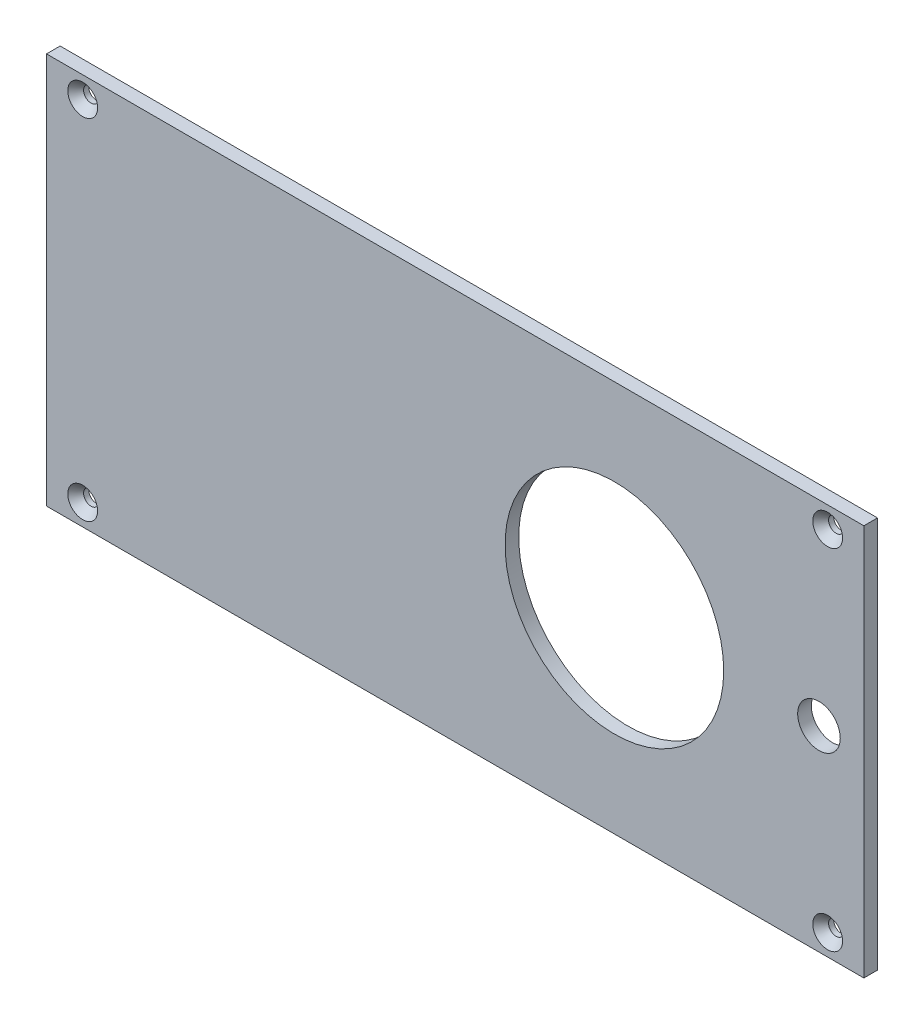
ISO-10303-21;
HEADER;
FILE_DESCRIPTION(('STEP AP214'),'2;1');
FILE_NAME('part.step','',(''),(''),'','','');
FILE_SCHEMA(('AUTOMOTIVE_DESIGN { 1 0 10303 214 1 1 1 1 }'));
ENDSEC;
DATA;
#1=APPLICATION_CONTEXT('core data for automotive mechanical design processes');
#2=APPLICATION_PROTOCOL_DEFINITION('international standard','automotive_design',2000,#1);
#3=PRODUCT_CONTEXT('',#1,'mechanical');
#4=PRODUCT('Part','Part','',(#3));
#5=PRODUCT_RELATED_PRODUCT_CATEGORY('part','',(#4));
#6=PRODUCT_DEFINITION_FORMATION('','',#4);
#7=PRODUCT_DEFINITION_CONTEXT('part definition',#1,'design');
#8=PRODUCT_DEFINITION('design','',#6,#7);
#9=PRODUCT_DEFINITION_SHAPE('','',#8);
#10=(LENGTH_UNIT() NAMED_UNIT(*) SI_UNIT(.MILLI.,.METRE.));
#11=(NAMED_UNIT(*) PLANE_ANGLE_UNIT() SI_UNIT($,.RADIAN.));
#12=(NAMED_UNIT(*) SI_UNIT($,.STERADIAN.) SOLID_ANGLE_UNIT());
#13=UNCERTAINTY_MEASURE_WITH_UNIT(LENGTH_MEASURE(1.E-05),#10,'distance_accuracy_value','');
#14=(GEOMETRIC_REPRESENTATION_CONTEXT(3) GLOBAL_UNCERTAINTY_ASSIGNED_CONTEXT((#13)) GLOBAL_UNIT_ASSIGNED_CONTEXT((#10,
#11,#12)) REPRESENTATION_CONTEXT('',''));
#15=CARTESIAN_POINT('',(0.,0.,0.));
#16=DIRECTION('',(0.,0.,1.));
#17=DIRECTION('',(1.,0.,0.));
#18=AXIS2_PLACEMENT_3D('',#15,#16,#17);
#19=CARTESIAN_POINT('',(0.,0.,1.6002));
#20=DIRECTION('',(1.,0.,0.));
#21=DIRECTION('',(0.,0.,-1.));
#22=AXIS2_PLACEMENT_3D('',#19,#20,#21);
#23=PLANE('',#22);
#24=DIRECTION('',(0.,-1.,0.));
#25=VECTOR('',#24,1.);
#26=CARTESIAN_POINT('',(0.,0.,0.));
#27=LINE('',#26,#25);
#28=CARTESIAN_POINT('',(0.,46.,0.));
#29=VERTEX_POINT('',#28);
#30=CARTESIAN_POINT('',(0.,0.,0.));
#31=VERTEX_POINT('',#30);
#32=EDGE_CURVE('E104',#29,#31,#27,.T.);
#33=ORIENTED_EDGE('',*,*,#32,.T.);
#34=DIRECTION('',(0.,0.,-1.));
#35=VECTOR('',#34,1.);
#36=CARTESIAN_POINT('',(0.,0.,1.6002));
#37=LINE('',#36,#35);
#38=CARTESIAN_POINT('',(0.,0.,1.6002));
#39=VERTEX_POINT('',#38);
#40=EDGE_CURVE('E11',#39,#31,#37,.T.);
#41=ORIENTED_EDGE('',*,*,#40,.F.);
#42=DIRECTION('',(0.,-1.,0.));
#43=VECTOR('',#42,1.);
#44=CARTESIAN_POINT('',(0.,0.,1.6002));
#45=LINE('',#44,#43);
#46=CARTESIAN_POINT('',(0.,46.,1.6002));
#47=VERTEX_POINT('',#46);
#48=EDGE_CURVE('E91',#47,#39,#45,.T.);
#49=ORIENTED_EDGE('',*,*,#48,.F.);
#50=DIRECTION('',(0.,0.,-1.));
#51=VECTOR('',#50,1.);
#52=CARTESIAN_POINT('',(0.,46.,1.6002));
#53=LINE('',#52,#51);
#54=EDGE_CURVE('E100',#47,#29,#53,.T.);
#55=ORIENTED_EDGE('',*,*,#54,.T.);
#56=EDGE_LOOP('',(#33,#41,#49,#55));
#57=FACE_BOUND('',#56,.T.);
#58=ADVANCED_FACE('F39',(#57),#23,.F.);
#59=CARTESIAN_POINT('',(0.,0.,1.6002));
#60=DIRECTION('',(0.,1.,0.));
#61=DIRECTION('',(0.,0.,1.));
#62=AXIS2_PLACEMENT_3D('',#59,#60,#61);
#63=PLANE('',#62);
#64=DIRECTION('',(1.,0.,0.));
#65=VECTOR('',#64,1.);
#66=CARTESIAN_POINT('',(0.,0.,0.));
#67=LINE('',#66,#65);
#68=CARTESIAN_POINT('',(96.,0.,0.));
#69=VERTEX_POINT('',#68);
#70=EDGE_CURVE('E95',#31,#69,#67,.T.);
#71=ORIENTED_EDGE('',*,*,#70,.T.);
#72=DIRECTION('',(0.,0.,-1.));
#73=VECTOR('',#72,1.);
#74=CARTESIAN_POINT('',(96.,0.,1.6002));
#75=LINE('',#74,#73);
#76=CARTESIAN_POINT('',(96.,0.,1.6002));
#77=VERTEX_POINT('',#76);
#78=EDGE_CURVE('E48',#77,#69,#75,.T.);
#79=ORIENTED_EDGE('',*,*,#78,.F.);
#80=DIRECTION('',(1.,0.,0.));
#81=VECTOR('',#80,1.);
#82=CARTESIAN_POINT('',(0.,0.,1.6002));
#83=LINE('',#82,#81);
#84=EDGE_CURVE('E86',#39,#77,#83,.T.);
#85=ORIENTED_EDGE('',*,*,#84,.F.);
#86=ORIENTED_EDGE('',*,*,#40,.T.);
#87=EDGE_LOOP('',(#71,#79,#85,#86));
#88=FACE_BOUND('',#87,.T.);
#89=ADVANCED_FACE('F94',(#88),#63,.F.);
#90=CARTESIAN_POINT('',(96.,0.,1.6002));
#91=DIRECTION('',(-1.,0.,0.));
#92=DIRECTION('',(0.,0.,1.));
#93=AXIS2_PLACEMENT_3D('',#90,#91,#92);
#94=PLANE('',#93);
#95=DIRECTION('',(0.,1.,0.));
#96=VECTOR('',#95,1.);
#97=CARTESIAN_POINT('',(96.,0.,0.));
#98=LINE('',#97,#96);
#99=CARTESIAN_POINT('',(96.,46.,0.));
#100=VERTEX_POINT('',#99);
#101=EDGE_CURVE('E73',#69,#100,#98,.T.);
#102=ORIENTED_EDGE('',*,*,#101,.T.);
#103=DIRECTION('',(0.,0.,-1.));
#104=VECTOR('',#103,1.);
#105=CARTESIAN_POINT('',(96.,46.,1.6002));
#106=LINE('',#105,#104);
#107=CARTESIAN_POINT('',(96.,46.,1.6002));
#108=VERTEX_POINT('',#107);
#109=EDGE_CURVE('E96',#108,#100,#106,.T.);
#110=ORIENTED_EDGE('',*,*,#109,.F.);
#111=DIRECTION('',(0.,1.,0.));
#112=VECTOR('',#111,1.);
#113=CARTESIAN_POINT('',(96.,0.,1.6002));
#114=LINE('',#113,#112);
#115=EDGE_CURVE('E89',#77,#108,#114,.T.);
#116=ORIENTED_EDGE('',*,*,#115,.F.);
#117=ORIENTED_EDGE('',*,*,#78,.T.);
#118=EDGE_LOOP('',(#102,#110,#116,#117));
#119=FACE_BOUND('',#118,.T.);
#120=ADVANCED_FACE('F98',(#119),#94,.F.);
#121=CARTESIAN_POINT('',(0.,46.,1.6002));
#122=DIRECTION('',(0.,-1.,0.));
#123=DIRECTION('',(0.,0.,-1.));
#124=AXIS2_PLACEMENT_3D('',#121,#122,#123);
#125=PLANE('',#124);
#126=DIRECTION('',(-1.,0.,0.));
#127=VECTOR('',#126,1.);
#128=CARTESIAN_POINT('',(0.,46.,0.));
#129=LINE('',#128,#127);
#130=EDGE_CURVE('E79',#100,#29,#129,.T.);
#131=ORIENTED_EDGE('',*,*,#130,.T.);
#132=ORIENTED_EDGE('',*,*,#54,.F.);
#133=DIRECTION('',(-1.,0.,0.));
#134=VECTOR('',#133,1.);
#135=CARTESIAN_POINT('',(0.,46.,1.6002));
#136=LINE('',#135,#134);
#137=EDGE_CURVE('E56',#108,#47,#136,.T.);
#138=ORIENTED_EDGE('',*,*,#137,.F.);
#139=ORIENTED_EDGE('',*,*,#109,.T.);
#140=EDGE_LOOP('',(#131,#132,#138,#139));
#141=FACE_BOUND('',#140,.T.);
#142=ADVANCED_FACE('F112',(#141),#125,.F.);
#143=CARTESIAN_POINT('',(0.,0.,1.6002));
#144=DIRECTION('',(0.,0.,-1.));
#145=DIRECTION('',(-1.,0.,0.));
#146=AXIS2_PLACEMENT_3D('',#143,#144,#145);
#147=PLANE('',#146);
#148=CARTESIAN_POINT('',(90.7270405436513,23.0000000000247,1.6002));
#149=DIRECTION('',(0.,0.,1.));
#150=DIRECTION('',(1.,0.,0.));
#151=AXIS2_PLACEMENT_3D('',#148,#149,#150);
#152=CIRCLE('',#151,2.50000000000001);
#153=CARTESIAN_POINT('',(93.2270405436513,23.0000000000247,1.6002));
#154=VERTEX_POINT('',#153);
#155=EDGE_CURVE('E159',#154,#154,#152,.T.);
#156=ORIENTED_EDGE('',*,*,#155,.F.);
#157=EDGE_LOOP('',(#156));
#158=FACE_BOUND('',#157,.T.);
#159=CARTESIAN_POINT('',(4.25,43.5,1.6002));
#160=DIRECTION('',(0.,0.,1.));
#161=DIRECTION('',(1.,0.,0.));
#162=AXIS2_PLACEMENT_3D('',#159,#160,#161);
#163=CIRCLE('',#162,1.7526);
#164=CARTESIAN_POINT('',(6.0026,43.5,1.6002));
#165=VERTEX_POINT('',#164);
#166=EDGE_CURVE('E156',#165,#165,#163,.T.);
#167=ORIENTED_EDGE('',*,*,#166,.F.);
#168=EDGE_LOOP('',(#167));
#169=FACE_BOUND('',#168,.T.);
#170=CARTESIAN_POINT('',(4.25000000000001,2.5,1.6002));
#171=DIRECTION('',(0.,0.,1.));
#172=DIRECTION('',(1.,0.,0.));
#173=AXIS2_PLACEMENT_3D('',#170,#171,#172);
#174=CIRCLE('',#173,1.7526);
#175=CARTESIAN_POINT('',(6.00260000000001,2.5,1.6002));
#176=VERTEX_POINT('',#175);
#177=EDGE_CURVE('E147',#176,#176,#174,.T.);
#178=ORIENTED_EDGE('',*,*,#177,.F.);
#179=EDGE_LOOP('',(#178));
#180=FACE_BOUND('',#179,.T.);
#181=CARTESIAN_POINT('',(91.75,2.50000000000002,1.6002));
#182=DIRECTION('',(0.,0.,1.));
#183=DIRECTION('',(1.,0.,0.));
#184=AXIS2_PLACEMENT_3D('',#181,#182,#183);
#185=CIRCLE('',#184,1.75259999999999);
#186=CARTESIAN_POINT('',(93.5026,2.50000000000002,1.6002));
#187=VERTEX_POINT('',#186);
#188=EDGE_CURVE('E138',#187,#187,#185,.T.);
#189=ORIENTED_EDGE('',*,*,#188,.F.);
#190=EDGE_LOOP('',(#189));
#191=FACE_BOUND('',#190,.T.);
#192=CARTESIAN_POINT('',(91.75,43.5,1.6002));
#193=DIRECTION('',(0.,0.,1.));
#194=DIRECTION('',(1.,0.,0.));
#195=AXIS2_PLACEMENT_3D('',#192,#193,#194);
#196=CIRCLE('',#195,1.75259999999999);
#197=CARTESIAN_POINT('',(93.5026,43.5,1.6002));
#198=VERTEX_POINT('',#197);
#199=EDGE_CURVE('E129',#198,#198,#196,.T.);
#200=ORIENTED_EDGE('',*,*,#199,.F.);
#201=EDGE_LOOP('',(#200));
#202=FACE_BOUND('',#201,.T.);
#203=CARTESIAN_POINT('',(66.7000000001694,23.0000000000245,1.6002));
#204=DIRECTION('',(0.,0.,1.));
#205=DIRECTION('',(1.,0.,0.));
#206=AXIS2_PLACEMENT_3D('',#203,#204,#205);
#207=CIRCLE('',#206,12.8396999999119);
#208=CARTESIAN_POINT('',(79.5397000000814,23.0000000000245,1.6002));
#209=VERTEX_POINT('',#208);
#210=EDGE_CURVE('E118',#209,#209,#207,.T.);
#211=ORIENTED_EDGE('',*,*,#210,.F.);
#212=EDGE_LOOP('',(#211));
#213=FACE_BOUND('',#212,.T.);
#214=ORIENTED_EDGE('',*,*,#48,.T.);
#215=ORIENTED_EDGE('',*,*,#84,.T.);
#216=ORIENTED_EDGE('',*,*,#115,.T.);
#217=ORIENTED_EDGE('',*,*,#137,.T.);
#218=EDGE_LOOP('',(#214,#215,#216,#217));
#219=FACE_BOUND('',#218,.T.);
#220=ADVANCED_FACE('F87',(#158,#169,#180,#191,#202,#213,#219),#147,.F.);
#221=CARTESIAN_POINT('',(0.,0.,0.));
#222=DIRECTION('',(0.,0.,-1.));
#223=DIRECTION('',(-1.,0.,0.));
#224=AXIS2_PLACEMENT_3D('',#221,#222,#223);
#225=PLANE('',#224);
#226=CARTESIAN_POINT('',(90.7270405436513,23.0000000000247,0.));
#227=DIRECTION('',(0.,0.,-1.));
#228=DIRECTION('',(-1.,0.,0.));
#229=AXIS2_PLACEMENT_3D('',#226,#227,#228);
#230=CIRCLE('',#229,2.50000000000001);
#231=CARTESIAN_POINT('',(88.2270405436512,23.0000000000247,0.));
#232=VERTEX_POINT('',#231);
#233=EDGE_CURVE('E42',#232,#232,#230,.T.);
#234=ORIENTED_EDGE('',*,*,#233,.F.);
#235=EDGE_LOOP('',(#234));
#236=FACE_BOUND('',#235,.T.);
#237=CARTESIAN_POINT('',(4.25,43.5,0.));
#238=DIRECTION('',(0.,0.,1.));
#239=DIRECTION('',(1.,0.,0.));
#240=AXIS2_PLACEMENT_3D('',#237,#238,#239);
#241=CIRCLE('',#240,0.888999999999999);
#242=CARTESIAN_POINT('',(5.139,43.5,0.));
#243=VERTEX_POINT('',#242);
#244=EDGE_CURVE('E150',#243,#243,#241,.T.);
#245=ORIENTED_EDGE('',*,*,#244,.T.);
#246=EDGE_LOOP('',(#245));
#247=FACE_BOUND('',#246,.T.);
#248=CARTESIAN_POINT('',(4.25000000000001,2.5,0.));
#249=DIRECTION('',(0.,0.,1.));
#250=DIRECTION('',(1.,0.,0.));
#251=AXIS2_PLACEMENT_3D('',#248,#249,#250);
#252=CIRCLE('',#251,0.888999999999999);
#253=CARTESIAN_POINT('',(5.139,2.5,0.));
#254=VERTEX_POINT('',#253);
#255=EDGE_CURVE('E141',#254,#254,#252,.T.);
#256=ORIENTED_EDGE('',*,*,#255,.T.);
#257=EDGE_LOOP('',(#256));
#258=FACE_BOUND('',#257,.T.);
#259=CARTESIAN_POINT('',(91.75,2.50000000000002,0.));
#260=DIRECTION('',(0.,0.,1.));
#261=DIRECTION('',(1.,0.,0.));
#262=AXIS2_PLACEMENT_3D('',#259,#260,#261);
#263=CIRCLE('',#262,0.889000000000001);
#264=CARTESIAN_POINT('',(92.639,2.50000000000002,0.));
#265=VERTEX_POINT('',#264);
#266=EDGE_CURVE('E132',#265,#265,#263,.T.);
#267=ORIENTED_EDGE('',*,*,#266,.T.);
#268=EDGE_LOOP('',(#267));
#269=FACE_BOUND('',#268,.T.);
#270=CARTESIAN_POINT('',(91.75,43.5,0.));
#271=DIRECTION('',(0.,0.,1.));
#272=DIRECTION('',(1.,0.,0.));
#273=AXIS2_PLACEMENT_3D('',#270,#271,#272);
#274=CIRCLE('',#273,0.889000000000001);
#275=CARTESIAN_POINT('',(92.639,43.5,0.));
#276=VERTEX_POINT('',#275);
#277=EDGE_CURVE('E121',#276,#276,#274,.T.);
#278=ORIENTED_EDGE('',*,*,#277,.T.);
#279=EDGE_LOOP('',(#278));
#280=FACE_BOUND('',#279,.T.);
#281=CARTESIAN_POINT('',(66.7000000001694,23.0000000000245,0.));
#282=DIRECTION('',(0.,0.,1.));
#283=DIRECTION('',(1.,0.,0.));
#284=AXIS2_PLACEMENT_3D('',#281,#282,#283);
#285=CIRCLE('',#284,12.8396999999119);
#286=CARTESIAN_POINT('',(79.5397000000814,23.0000000000245,0.));
#287=VERTEX_POINT('',#286);
#288=EDGE_CURVE('E107',#287,#287,#285,.T.);
#289=ORIENTED_EDGE('',*,*,#288,.T.);
#290=EDGE_LOOP('',(#289));
#291=FACE_BOUND('',#290,.T.);
#292=ORIENTED_EDGE('',*,*,#32,.F.);
#293=ORIENTED_EDGE('',*,*,#130,.F.);
#294=ORIENTED_EDGE('',*,*,#101,.F.);
#295=ORIENTED_EDGE('',*,*,#70,.F.);
#296=EDGE_LOOP('',(#292,#293,#294,#295));
#297=FACE_BOUND('',#296,.T.);
#298=ADVANCED_FACE('F115',(#236,#247,#258,#269,#280,#291,#297),#225,.T.);
#299=CARTESIAN_POINT('',(66.7000000001694,23.0000000000245,0.));
#300=DIRECTION('',(0.,0.,1.));
#301=DIRECTION('',(1.,0.,0.));
#302=AXIS2_PLACEMENT_3D('',#299,#300,#301);
#303=CYLINDRICAL_SURFACE('',#302,12.8396999999119);
#304=ORIENTED_EDGE('',*,*,#288,.F.);
#305=EDGE_LOOP('',(#304));
#306=FACE_BOUND('',#305,.T.);
#307=ORIENTED_EDGE('',*,*,#210,.T.);
#308=EDGE_LOOP('',(#307));
#309=FACE_BOUND('',#308,.T.);
#310=ADVANCED_FACE('F170',(#306,#309),#303,.F.);
#311=CARTESIAN_POINT('',(91.75,43.5,1.6002));
#312=DIRECTION('',(0.,0.,1.));
#313=DIRECTION('',(1.,0.,0.));
#314=AXIS2_PLACEMENT_3D('',#311,#312,#313);
#315=CYLINDRICAL_SURFACE('',#314,0.889000000000001);
#316=ORIENTED_EDGE('',*,*,#277,.F.);
#317=EDGE_LOOP('',(#316));
#318=FACE_BOUND('',#317,.T.);
#319=CARTESIAN_POINT('',(91.75,43.5,0.606741843523936));
#320=DIRECTION('',(0.,0.,1.));
#321=DIRECTION('',(1.,0.,0.));
#322=AXIS2_PLACEMENT_3D('',#319,#320,#321);
#323=CIRCLE('',#322,0.889000000000001);
#324=CARTESIAN_POINT('',(92.639,43.5,0.606741843523936));
#325=VERTEX_POINT('',#324);
#326=EDGE_CURVE('E126',#325,#325,#323,.T.);
#327=ORIENTED_EDGE('',*,*,#326,.T.);
#328=EDGE_LOOP('',(#327));
#329=FACE_BOUND('',#328,.T.);
#330=ADVANCED_FACE('F184',(#318,#329),#315,.F.);
#331=CARTESIAN_POINT('',(91.75,43.5,1.6002));
#332=DIRECTION('',(0.,0.,1.));
#333=DIRECTION('',(1.,0.,0.));
#334=AXIS2_PLACEMENT_3D('',#331,#332,#333);
#335=CONICAL_SURFACE('',#334,1.75259999999999,0.715584993317671);
#336=ORIENTED_EDGE('',*,*,#326,.F.);
#337=EDGE_LOOP('',(#336));
#338=FACE_BOUND('',#337,.T.);
#339=ORIENTED_EDGE('',*,*,#199,.T.);
#340=EDGE_LOOP('',(#339));
#341=FACE_BOUND('',#340,.T.);
#342=ADVANCED_FACE('F228',(#338,#341),#335,.F.);
#343=CARTESIAN_POINT('',(91.75,2.50000000000002,1.6002));
#344=DIRECTION('',(0.,0.,1.));
#345=DIRECTION('',(1.,0.,0.));
#346=AXIS2_PLACEMENT_3D('',#343,#344,#345);
#347=CYLINDRICAL_SURFACE('',#346,0.889000000000001);
#348=ORIENTED_EDGE('',*,*,#266,.F.);
#349=EDGE_LOOP('',(#348));
#350=FACE_BOUND('',#349,.T.);
#351=CARTESIAN_POINT('',(91.75,2.50000000000002,0.606741843523936));
#352=DIRECTION('',(0.,0.,1.));
#353=DIRECTION('',(1.,0.,0.));
#354=AXIS2_PLACEMENT_3D('',#351,#352,#353);
#355=CIRCLE('',#354,0.889000000000001);
#356=CARTESIAN_POINT('',(92.639,2.50000000000002,0.606741843523936));
#357=VERTEX_POINT('',#356);
#358=EDGE_CURVE('E135',#357,#357,#355,.T.);
#359=ORIENTED_EDGE('',*,*,#358,.T.);
#360=EDGE_LOOP('',(#359));
#361=FACE_BOUND('',#360,.T.);
#362=ADVANCED_FACE('F239',(#350,#361),#347,.F.);
#363=CARTESIAN_POINT('',(91.75,2.50000000000002,1.6002));
#364=DIRECTION('',(0.,0.,1.));
#365=DIRECTION('',(1.,0.,0.));
#366=AXIS2_PLACEMENT_3D('',#363,#364,#365);
#367=CONICAL_SURFACE('',#366,1.75259999999999,0.715584993317671);
#368=ORIENTED_EDGE('',*,*,#358,.F.);
#369=EDGE_LOOP('',(#368));
#370=FACE_BOUND('',#369,.T.);
#371=ORIENTED_EDGE('',*,*,#188,.T.);
#372=EDGE_LOOP('',(#371));
#373=FACE_BOUND('',#372,.T.);
#374=ADVANCED_FACE('F250',(#370,#373),#367,.F.);
#375=CARTESIAN_POINT('',(4.25000000000001,2.5,1.6002));
#376=DIRECTION('',(0.,0.,1.));
#377=DIRECTION('',(1.,0.,0.));
#378=AXIS2_PLACEMENT_3D('',#375,#376,#377);
#379=CYLINDRICAL_SURFACE('',#378,0.889);
#380=ORIENTED_EDGE('',*,*,#255,.F.);
#381=EDGE_LOOP('',(#380));
#382=FACE_BOUND('',#381,.T.);
#383=CARTESIAN_POINT('',(4.25000000000001,2.5,0.606741843523936));
#384=DIRECTION('',(0.,0.,1.));
#385=DIRECTION('',(1.,0.,0.));
#386=AXIS2_PLACEMENT_3D('',#383,#384,#385);
#387=CIRCLE('',#386,0.889);
#388=CARTESIAN_POINT('',(5.13900000000001,2.5,0.606741843523936));
#389=VERTEX_POINT('',#388);
#390=EDGE_CURVE('E144',#389,#389,#387,.T.);
#391=ORIENTED_EDGE('',*,*,#390,.T.);
#392=EDGE_LOOP('',(#391));
#393=FACE_BOUND('',#392,.T.);
#394=ADVANCED_FACE('F261',(#382,#393),#379,.F.);
#395=CARTESIAN_POINT('',(4.25000000000001,2.5,1.6002));
#396=DIRECTION('',(0.,0.,1.));
#397=DIRECTION('',(1.,0.,0.));
#398=AXIS2_PLACEMENT_3D('',#395,#396,#397);
#399=CONICAL_SURFACE('',#398,1.7526,0.715584993317675);
#400=ORIENTED_EDGE('',*,*,#390,.F.);
#401=EDGE_LOOP('',(#400));
#402=FACE_BOUND('',#401,.T.);
#403=ORIENTED_EDGE('',*,*,#177,.T.);
#404=EDGE_LOOP('',(#403));
#405=FACE_BOUND('',#404,.T.);
#406=ADVANCED_FACE('F272',(#402,#405),#399,.F.);
#407=CARTESIAN_POINT('',(4.25,43.5,1.6002));
#408=DIRECTION('',(0.,0.,1.));
#409=DIRECTION('',(1.,0.,0.));
#410=AXIS2_PLACEMENT_3D('',#407,#408,#409);
#411=CYLINDRICAL_SURFACE('',#410,0.889);
#412=ORIENTED_EDGE('',*,*,#244,.F.);
#413=EDGE_LOOP('',(#412));
#414=FACE_BOUND('',#413,.T.);
#415=CARTESIAN_POINT('',(4.25,43.5,0.606741843523936));
#416=DIRECTION('',(0.,0.,1.));
#417=DIRECTION('',(1.,0.,0.));
#418=AXIS2_PLACEMENT_3D('',#415,#416,#417);
#419=CIRCLE('',#418,0.889);
#420=CARTESIAN_POINT('',(5.139,43.5,0.606741843523936));
#421=VERTEX_POINT('',#420);
#422=EDGE_CURVE('E153',#421,#421,#419,.T.);
#423=ORIENTED_EDGE('',*,*,#422,.T.);
#424=EDGE_LOOP('',(#423));
#425=FACE_BOUND('',#424,.T.);
#426=ADVANCED_FACE('F283',(#414,#425),#411,.F.);
#427=CARTESIAN_POINT('',(4.25,43.5,1.6002));
#428=DIRECTION('',(0.,0.,1.));
#429=DIRECTION('',(1.,0.,0.));
#430=AXIS2_PLACEMENT_3D('',#427,#428,#429);
#431=CONICAL_SURFACE('',#430,1.7526,0.715584993317675);
#432=ORIENTED_EDGE('',*,*,#422,.F.);
#433=EDGE_LOOP('',(#432));
#434=FACE_BOUND('',#433,.T.);
#435=ORIENTED_EDGE('',*,*,#166,.T.);
#436=EDGE_LOOP('',(#435));
#437=FACE_BOUND('',#436,.T.);
#438=ADVANCED_FACE('F294',(#434,#437),#431,.F.);
#439=CARTESIAN_POINT('',(90.7270405436513,23.0000000000247,-8.3998));
#440=DIRECTION('',(0.,0.,1.));
#441=DIRECTION('',(1.,0.,0.));
#442=AXIS2_PLACEMENT_3D('',#439,#440,#441);
#443=CYLINDRICAL_SURFACE('',#442,2.50000000000001);
#444=ORIENTED_EDGE('',*,*,#233,.T.);
#445=EDGE_LOOP('',(#444));
#446=FACE_BOUND('',#445,.T.);
#447=ORIENTED_EDGE('',*,*,#155,.T.);
#448=EDGE_LOOP('',(#447));
#449=FACE_BOUND('',#448,.T.);
#450=ADVANCED_FACE('F166',(#446,#449),#443,.F.);
#451=CLOSED_SHELL('',(#58,#89,#120,#142,#220,#298,#310,#330,#342,#362,#374,#394,#406,#426,#438,#450));
#452=MANIFOLD_SOLID_BREP('B2',#451);
#453=ADVANCED_BREP_SHAPE_REPRESENTATION('',(#18,#452),#14);
#454=SHAPE_DEFINITION_REPRESENTATION(#9,#453);
ENDSEC;
END-ISO-10303-21;
